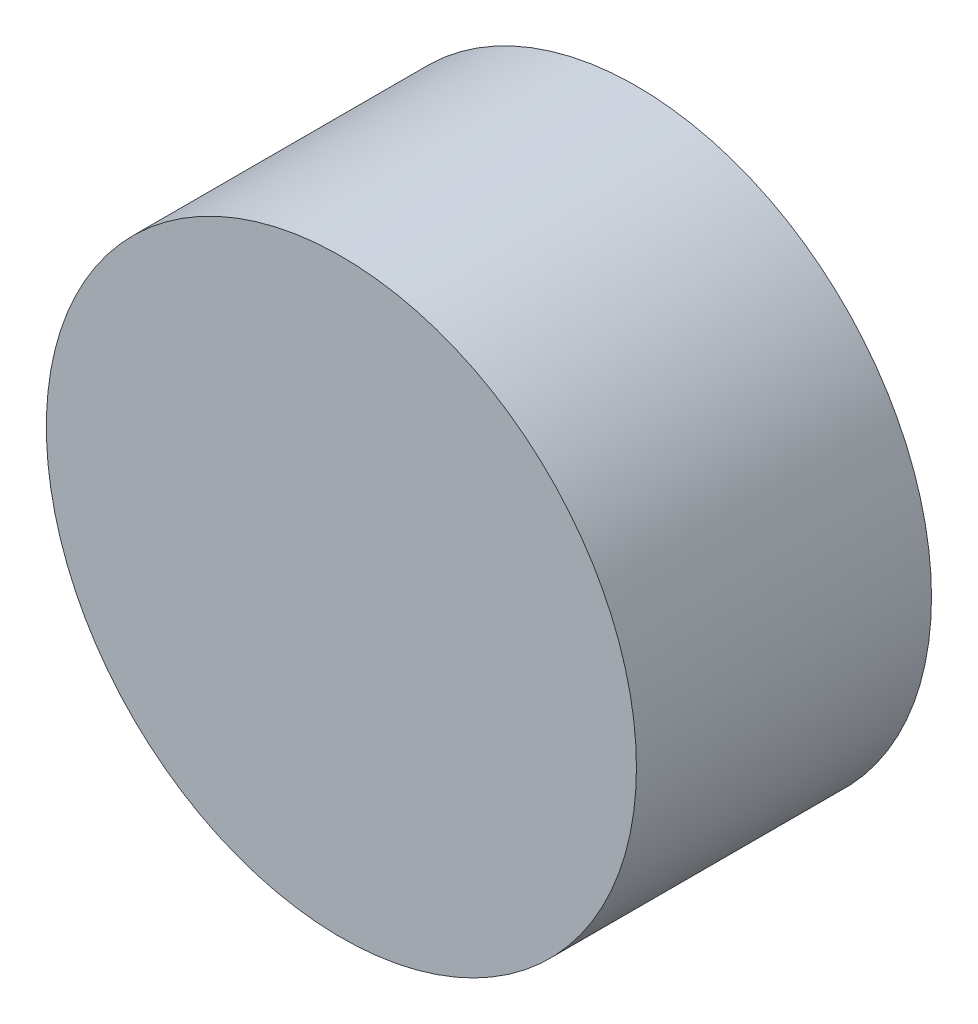
ISO-10303-21;
HEADER;
FILE_DESCRIPTION(('STEP AP214'),'2;1');
FILE_NAME('part.step','',(''),(''),'','','');
FILE_SCHEMA(('AUTOMOTIVE_DESIGN { 1 0 10303 214 1 1 1 1 }'));
ENDSEC;
DATA;
#1=APPLICATION_CONTEXT('core data for automotive mechanical design processes');
#2=APPLICATION_PROTOCOL_DEFINITION('international standard','automotive_design',2000,#1);
#3=PRODUCT_CONTEXT('',#1,'mechanical');
#4=PRODUCT('Part','Part','',(#3));
#5=PRODUCT_RELATED_PRODUCT_CATEGORY('part','',(#4));
#6=PRODUCT_DEFINITION_FORMATION('','',#4);
#7=PRODUCT_DEFINITION_CONTEXT('part definition',#1,'design');
#8=PRODUCT_DEFINITION('design','',#6,#7);
#9=PRODUCT_DEFINITION_SHAPE('','',#8);
#10=(LENGTH_UNIT() NAMED_UNIT(*) SI_UNIT(.MILLI.,.METRE.));
#11=(NAMED_UNIT(*) PLANE_ANGLE_UNIT() SI_UNIT($,.RADIAN.));
#12=(NAMED_UNIT(*) SI_UNIT($,.STERADIAN.) SOLID_ANGLE_UNIT());
#13=UNCERTAINTY_MEASURE_WITH_UNIT(LENGTH_MEASURE(1.E-05),#10,'distance_accuracy_value','');
#14=(GEOMETRIC_REPRESENTATION_CONTEXT(3) GLOBAL_UNCERTAINTY_ASSIGNED_CONTEXT((#13)) GLOBAL_UNIT_ASSIGNED_CONTEXT((#10,
#11,#12)) REPRESENTATION_CONTEXT('',''));
#15=CARTESIAN_POINT('',(0.,0.,0.));
#16=DIRECTION('',(0.,0.,1.));
#17=DIRECTION('',(1.,0.,0.));
#18=AXIS2_PLACEMENT_3D('',#15,#16,#17);
#19=CARTESIAN_POINT('',(0.,0.,-101.6));
#20=DIRECTION('',(0.,0.,1.));
#21=DIRECTION('',(1.,0.,0.));
#22=AXIS2_PLACEMENT_3D('',#19,#20,#21);
#23=CYLINDRICAL_SURFACE('',#22,101.6);
#24=CARTESIAN_POINT('',(0.,0.,-101.6));
#25=DIRECTION('',(0.,0.,1.));
#26=DIRECTION('',(1.,0.,0.));
#27=AXIS2_PLACEMENT_3D('',#24,#25,#26);
#28=CIRCLE('',#27,101.6);
#29=CARTESIAN_POINT('',(101.6,0.,-101.6));
#30=VERTEX_POINT('',#29);
#31=EDGE_CURVE('E10',#30,#30,#28,.T.);
#32=ORIENTED_EDGE('',*,*,#31,.T.);
#33=EDGE_LOOP('',(#32));
#34=FACE_BOUND('',#33,.T.);
#35=CARTESIAN_POINT('',(0.,0.,0.));
#36=DIRECTION('',(0.,0.,1.));
#37=DIRECTION('',(1.,0.,0.));
#38=AXIS2_PLACEMENT_3D('',#35,#36,#37);
#39=CIRCLE('',#38,101.6);
#40=CARTESIAN_POINT('',(101.6,0.,0.));
#41=VERTEX_POINT('',#40);
#42=EDGE_CURVE('E40',#41,#41,#39,.T.);
#43=ORIENTED_EDGE('',*,*,#42,.F.);
#44=EDGE_LOOP('',(#43));
#45=FACE_BOUND('',#44,.T.);
#46=ADVANCED_FACE('F37',(#34,#45),#23,.T.);
#47=CARTESIAN_POINT('',(0.,0.,-101.6));
#48=DIRECTION('',(0.,0.,1.));
#49=DIRECTION('',(1.,0.,0.));
#50=AXIS2_PLACEMENT_3D('',#47,#48,#49);
#51=PLANE('',#50);
#52=ORIENTED_EDGE('',*,*,#31,.F.);
#53=EDGE_LOOP('',(#52));
#54=FACE_BOUND('',#53,.T.);
#55=ADVANCED_FACE('F54',(#54),#51,.F.);
#56=CARTESIAN_POINT('',(0.,0.,0.));
#57=DIRECTION('',(0.,0.,1.));
#58=DIRECTION('',(1.,0.,0.));
#59=AXIS2_PLACEMENT_3D('',#56,#57,#58);
#60=PLANE('',#59);
#61=ORIENTED_EDGE('',*,*,#42,.T.);
#62=EDGE_LOOP('',(#61));
#63=FACE_BOUND('',#62,.T.);
#64=ADVANCED_FACE('F51',(#63),#60,.T.);
#65=CLOSED_SHELL('',(#46,#55,#64));
#66=MANIFOLD_SOLID_BREP('B2',#65);
#67=ADVANCED_BREP_SHAPE_REPRESENTATION('',(#18,#66),#14);
#68=SHAPE_DEFINITION_REPRESENTATION(#9,#67);
ENDSEC;
END-ISO-10303-21;
